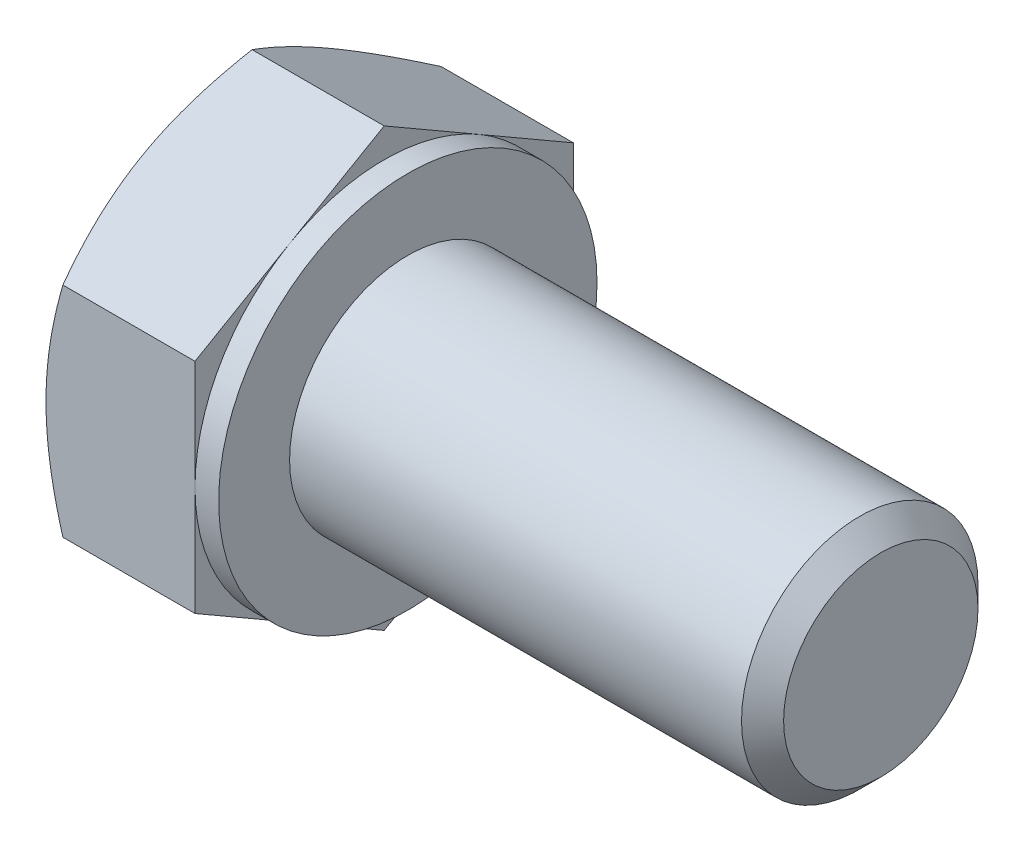
ISO-10303-21;
HEADER;
FILE_DESCRIPTION(('STEP AP214'),'2;1');
FILE_NAME('part.step','',(''),(''),'','','');
FILE_SCHEMA(('AUTOMOTIVE_DESIGN { 1 0 10303 214 1 1 1 1 }'));
ENDSEC;
DATA;
#1=APPLICATION_CONTEXT('core data for automotive mechanical design processes');
#2=APPLICATION_PROTOCOL_DEFINITION('international standard','automotive_design',2000,#1);
#3=PRODUCT_CONTEXT('',#1,'mechanical');
#4=PRODUCT('Part','Part','',(#3));
#5=PRODUCT_RELATED_PRODUCT_CATEGORY('part','',(#4));
#6=PRODUCT_DEFINITION_FORMATION('','',#4);
#7=PRODUCT_DEFINITION_CONTEXT('part definition',#1,'design');
#8=PRODUCT_DEFINITION('design','',#6,#7);
#9=PRODUCT_DEFINITION_SHAPE('','',#8);
#10=(LENGTH_UNIT() NAMED_UNIT(*) SI_UNIT(.MILLI.,.METRE.));
#11=(NAMED_UNIT(*) PLANE_ANGLE_UNIT() SI_UNIT($,.RADIAN.));
#12=(NAMED_UNIT(*) SI_UNIT($,.STERADIAN.) SOLID_ANGLE_UNIT());
#13=UNCERTAINTY_MEASURE_WITH_UNIT(LENGTH_MEASURE(1.E-05),#10,'distance_accuracy_value','');
#14=(GEOMETRIC_REPRESENTATION_CONTEXT(3) GLOBAL_UNCERTAINTY_ASSIGNED_CONTEXT((#13)) GLOBAL_UNIT_ASSIGNED_CONTEXT((#10,
#11,#12)) REPRESENTATION_CONTEXT('',''));
#15=CARTESIAN_POINT('',(0.,0.,0.));
#16=DIRECTION('',(0.,0.,1.));
#17=DIRECTION('',(1.,0.,0.));
#18=AXIS2_PLACEMENT_3D('',#15,#16,#17);
#19=CARTESIAN_POINT('',(3.65,2.3094010767585,-4.));
#20=DIRECTION('',(0.,-0.866025403784438,0.500000000000001));
#21=DIRECTION('',(0.,-0.500000000000001,-0.866025403784438));
#22=AXIS2_PLACEMENT_3D('',#19,#20,#21);
#23=PLANE('',#22);
#24=DIRECTION('',(0.,0.500000000000001,0.866025403784438));
#25=VECTOR('',#24,1.);
#26=CARTESIAN_POINT('',(3.15,2.3094010767585,-4.));
#27=LINE('',#26,#25);
#28=CARTESIAN_POINT('',(3.15,2.3094010767585,-4.));
#29=VERTEX_POINT('',#28);
#30=CARTESIAN_POINT('',(3.15,3.46410161513775,-2.));
#31=VERTEX_POINT('',#30);
#32=EDGE_CURVE('E168',#29,#31,#27,.T.);
#33=ORIENTED_EDGE('',*,*,#32,.F.);
#34=DIRECTION('',(-1.,0.,0.));
#35=VECTOR('',#34,1.);
#36=CARTESIAN_POINT('',(3.65,2.3094010767585,-4.));
#37=LINE('',#36,#35);
#38=CARTESIAN_POINT('',(0.35726558990816,2.3094010767585,-4.));
#39=VERTEX_POINT('',#38);
#40=EDGE_CURVE('E301',#29,#39,#37,.T.);
#41=ORIENTED_EDGE('',*,*,#40,.T.);
#42=CARTESIAN_POINT('',(0.357332259074767,4.61891762357085,0.0002));
#43=CARTESIAN_POINT('',(0.298717873648282,4.51743148381381,-0.175579150323228));
#44=CARTESIAN_POINT('',(0.245410321462263,4.41506932144052,-0.352875616326381));
#45=CARTESIAN_POINT('',(0.152361670746403,4.2085725054774,-0.710538593175706));
#46=CARTESIAN_POINT('',(0.112653489029704,4.10443418285647,-0.890911458970151));
#47=CARTESIAN_POINT('',(0.0508422152802784,3.89744813015756,-1.24942181870279));
#48=CARTESIAN_POINT('',(0.028327731522888,3.79463224655059,-1.42750415293514));
#49=CARTESIAN_POINT('',(0.00145062314658078,3.58851671999023,-1.78450671716651));
#50=CARTESIAN_POINT('',(-0.00293425857305782,3.48521782616117,-1.9634256496441));
#51=CARTESIAN_POINT('',(0.00619007293996873,3.29219970504619,-2.29774284219673));
#52=CARTESIAN_POINT('',(0.0174589539879923,3.20245157692486,-2.45319115998707));
#53=CARTESIAN_POINT('',(0.053173990798191,3.02354002635496,-2.76307505563506));
#54=CARTESIAN_POINT('',(0.0776323457115309,2.93437722268072,-2.91750956174413));
#55=CARTESIAN_POINT('',(0.138776064919287,2.75509682012354,-3.22803232777458));
#56=CARTESIAN_POINT('',(0.175720603654861,2.66500191089419,-3.3840812880631));
#57=CARTESIAN_POINT('',(0.259570072548024,2.486155802,-3.69385183540384));
#58=CARTESIAN_POINT('',(0.306455302212737,2.39740231122584,-3.84757739077378));
#59=CARTESIAN_POINT('',(0.357332259074764,2.30928560670466,-4.0002));
#60=B_SPLINE_CURVE_WITH_KNOTS('',3,(#42,#43,#44,#45,#46,#47,#48,#49,#50,#51,#52,#53,#54,#55,#56,
#57,#58,#59),.UNSPECIFIED.,.F.,.F.,(4,2,2,2,2,2,2,2,4),(0.,0.634047835695966,1.26961969224543,
1.88946157213122,2.50854226669297,3.04757825393386,3.58711366126904,4.13861653143764,
4.68903648037743),.UNSPECIFIED.);
#61=CARTESIAN_POINT('',(0.,3.46410161513775,-2.));
#62=VERTEX_POINT('',#61);
#63=EDGE_CURVE('E222',#62,#39,#60,.T.);
#64=ORIENTED_EDGE('',*,*,#63,.F.);
#65=CARTESIAN_POINT('',(0.357265589908162,4.61880215351701,0.));
#66=VERTEX_POINT('',#65);
#67=EDGE_CURVE('E59',#66,#62,#60,.T.);
#68=ORIENTED_EDGE('',*,*,#67,.F.);
#69=DIRECTION('',(-1.,0.,0.));
#70=VECTOR('',#69,1.);
#71=CARTESIAN_POINT('',(3.65,4.61880215351701,0.));
#72=LINE('',#71,#70);
#73=CARTESIAN_POINT('',(3.15,4.61880215351701,0.));
#74=VERTEX_POINT('',#73);
#75=EDGE_CURVE('E251',#74,#66,#72,.T.);
#76=ORIENTED_EDGE('',*,*,#75,.F.);
#77=EDGE_CURVE('E166',#31,#74,#27,.T.);
#78=ORIENTED_EDGE('',*,*,#77,.F.);
#79=EDGE_LOOP('',(#33,#41,#64,#68,#76,#78));
#80=FACE_BOUND('',#79,.T.);
#81=ADVANCED_FACE('F36',(#80),#23,.F.);
#82=CARTESIAN_POINT('',(3.65,4.61880215351701,0.));
#83=DIRECTION('',(0.,-0.866025403784438,-0.500000000000001));
#84=DIRECTION('',(0.,0.500000000000001,-0.866025403784438));
#85=AXIS2_PLACEMENT_3D('',#82,#83,#84);
#86=PLANE('',#85);
#87=DIRECTION('',(0.,-0.500000000000001,0.866025403784438));
#88=VECTOR('',#87,1.);
#89=CARTESIAN_POINT('',(3.15,4.61880215351701,0.));
#90=LINE('',#89,#88);
#91=CARTESIAN_POINT('',(3.15,3.46410161513775,2.));
#92=VERTEX_POINT('',#91);
#93=EDGE_CURVE('E165',#74,#92,#90,.T.);
#94=ORIENTED_EDGE('',*,*,#93,.F.);
#95=ORIENTED_EDGE('',*,*,#75,.T.);
#96=CARTESIAN_POINT('',(0.357332259074765,2.30928560670466,4.0002));
#97=CARTESIAN_POINT('',(0.29871787364828,2.4107717464617,3.82442084967677));
#98=CARTESIAN_POINT('',(0.245410321462261,2.51313390883499,3.64712438367362));
#99=CARTESIAN_POINT('',(0.152361670746402,2.71963072479811,3.28946140682429));
#100=CARTESIAN_POINT('',(0.112653489029703,2.82376904741904,3.10908854102985));
#101=CARTESIAN_POINT('',(0.050842215280278,3.03075510011795,2.75057818129721));
#102=CARTESIAN_POINT('',(0.0283277315228875,3.13357098372492,2.57249584706486));
#103=CARTESIAN_POINT('',(0.00145062314658079,3.33968651028528,2.21549328283349));
#104=CARTESIAN_POINT('',(-0.00293425857305726,3.44298540411434,2.0365743503559));
#105=CARTESIAN_POINT('',(0.00619007293996988,3.63600352522932,1.70225715780327));
#106=CARTESIAN_POINT('',(0.0174589539879935,3.72575165335065,1.54680884001293));
#107=CARTESIAN_POINT('',(0.0531739907981926,3.90466320392054,1.23692494436494));
#108=CARTESIAN_POINT('',(0.0776323457115329,3.99382600759478,1.08249043825587));
#109=CARTESIAN_POINT('',(0.138776064919289,4.17310641015197,0.771967672225422));
#110=CARTESIAN_POINT('',(0.175720603654863,4.26320131938131,0.615918711936898));
#111=CARTESIAN_POINT('',(0.259570072548027,4.4420474282755,0.306148164596161));
#112=CARTESIAN_POINT('',(0.306455302212739,4.53080091904966,0.152422609226221));
#113=CARTESIAN_POINT('',(0.357332259074767,4.61891762357085,-0.000199999999999708));
#114=B_SPLINE_CURVE_WITH_KNOTS('',3,(#96,#97,#98,#99,#100,#101,#102,#103,#104,#105,#106,#107,
#108,#109,#110,#111,#112,#113),.UNSPECIFIED.,.F.,.F.,(4,2,2,2,2,2,2,2,4),(0.,0.634047835695966,
1.26961969224543,1.88946157213122,2.50854226669297,3.04757825393386,3.58711366126903,
4.13861653143764,4.68903648037743),.UNSPECIFIED.);
#115=CARTESIAN_POINT('',(0.,3.46410161513775,2.));
#116=VERTEX_POINT('',#115);
#117=EDGE_CURVE('E219',#116,#66,#114,.T.);
#118=ORIENTED_EDGE('',*,*,#117,.F.);
#119=CARTESIAN_POINT('',(0.35726558990816,2.3094010767585,4.));
#120=VERTEX_POINT('',#119);
#121=EDGE_CURVE('E232',#120,#116,#114,.T.);
#122=ORIENTED_EDGE('',*,*,#121,.F.);
#123=DIRECTION('',(-1.,0.,0.));
#124=VECTOR('',#123,1.);
#125=CARTESIAN_POINT('',(3.65,2.3094010767585,4.));
#126=LINE('',#125,#124);
#127=CARTESIAN_POINT('',(3.15,2.3094010767585,4.));
#128=VERTEX_POINT('',#127);
#129=EDGE_CURVE('E257',#128,#120,#126,.T.);
#130=ORIENTED_EDGE('',*,*,#129,.F.);
#131=EDGE_CURVE('E133',#92,#128,#90,.T.);
#132=ORIENTED_EDGE('',*,*,#131,.F.);
#133=EDGE_LOOP('',(#94,#95,#118,#122,#130,#132));
#134=FACE_BOUND('',#133,.T.);
#135=ADVANCED_FACE('F239',(#134),#86,.F.);
#136=CARTESIAN_POINT('',(3.65,2.3094010767585,4.));
#137=DIRECTION('',(0.,0.,-1.));
#138=DIRECTION('',(0.,1.,0.));
#139=AXIS2_PLACEMENT_3D('',#136,#137,#138);
#140=PLANE('',#139);
#141=DIRECTION('',(0.,-1.,0.));
#142=VECTOR('',#141,1.);
#143=CARTESIAN_POINT('',(3.15,2.3094010767585,4.));
#144=LINE('',#143,#142);
#145=CARTESIAN_POINT('',(3.15,0.,4.));
#146=VERTEX_POINT('',#145);
#147=EDGE_CURVE('E127',#128,#146,#144,.T.);
#148=ORIENTED_EDGE('',*,*,#147,.F.);
#149=ORIENTED_EDGE('',*,*,#129,.T.);
#150=CARTESIAN_POINT('',(2.00011120589742,-6.30203842761111,4.));
#151=CARTESIAN_POINT('',(1.91454696498875,-6.12645846908573,4.));
#152=CARTESIAN_POINT('',(1.82977515877992,-5.95048585830454,4.));
#153=CARTESIAN_POINT('',(1.66226027831945,-5.59754684504876,4.));
#154=CARTESIAN_POINT('',(1.57951750565516,-5.42058029958676,4.));
#155=CARTESIAN_POINT('',(1.41610926315703,-5.06457985358151,4.));
#156=CARTESIAN_POINT('',(1.33545672742032,-4.88553999633136,4.));
#157=CARTESIAN_POINT('',(1.17732358085362,-4.52607013308824,4.));
#158=CARTESIAN_POINT('',(1.09984282639236,-4.34564019048467,4.));
#159=CARTESIAN_POINT('',(0.946328318347811,-3.97695712450866,4.));
#160=CARTESIAN_POINT('',(0.870432704529686,-3.7886461766802,4.));
#161=CARTESIAN_POINT('',(0.724150215973385,-3.40985798992394,4.));
#162=CARTESIAN_POINT('',(0.653763945273167,-3.21938051607554,4.));
#163=CARTESIAN_POINT('',(0.520275623504079,-2.83628177128504,4.));
#164=CARTESIAN_POINT('',(0.457159651374151,-2.64366539864627,4.));
#165=CARTESIAN_POINT('',(0.340171517554838,-2.25567134331568,4.));
#166=CARTESIAN_POINT('',(0.286296547637716,-2.06029451909569,4.));
#167=CARTESIAN_POINT('',(0.190596079795566,-1.66775019580151,4.));
#168=CARTESIAN_POINT('',(0.148703055516463,-1.47059946092578,4.));
#169=CARTESIAN_POINT('',(0.0792701945625795,-1.07374632347739,4.));
#170=CARTESIAN_POINT('',(0.0517287925825719,-0.874044201615003,4.));
#171=CARTESIAN_POINT('',(0.013551736981097,-0.475733691865657,4.));
#172=CARTESIAN_POINT('',(0.00269106568150254,-0.277147418102504,4.));
#173=CARTESIAN_POINT('',(-0.00180277185473747,0.120241437274129,4.));
#174=CARTESIAN_POINT('',(0.00456430935448203,0.319044021953532,4.));
#175=CARTESIAN_POINT('',(0.0293199842587319,0.653649133068299,4.));
#176=CARTESIAN_POINT('',(0.043348769660897,0.789796206499814,4.));
#177=CARTESIAN_POINT('',(0.0786650587211751,1.0611517992991,4.));
#178=CARTESIAN_POINT('',(0.0999534653997827,1.1963601997699,4.));
#179=CARTESIAN_POINT('',(0.173595113230304,1.60036108975571,4.));
#180=CARTESIAN_POINT('',(0.235713609865279,1.86739658303732,4.));
#181=CARTESIAN_POINT('',(0.344187907647022,2.26690842404958,4.));
#182=CARTESIAN_POINT('',(0.383434484333358,2.40143348571872,4.));
#183=CARTESIAN_POINT('',(0.466191102609247,2.66917849490935,4.));
#184=CARTESIAN_POINT('',(0.509701177188774,2.80239843232331,4.));
#185=CARTESIAN_POINT('',(0.600271094434187,3.06757339383921,4.));
#186=CARTESIAN_POINT('',(0.647329943862151,3.19952876030404,4.));
#187=CARTESIAN_POINT('',(0.744425096631931,3.46233234223973,4.));
#188=CARTESIAN_POINT('',(0.794461330917676,3.59318058330841,4.));
#189=CARTESIAN_POINT('',(0.933355739925497,3.94627302392211,4.));
#190=CARTESIAN_POINT('',(1.0245987610664,4.16757823857484,4.));
#191=CARTESIAN_POINT('',(1.212472284956,4.60789849928791,4.));
#192=CARTESIAN_POINT('',(1.30910339372387,4.82691328443148,4.));
#193=CARTESIAN_POINT('',(1.50647026715799,5.26317250533755,4.));
#194=CARTESIAN_POINT('',(1.60720747010151,5.48041628821979,4.));
#195=CARTESIAN_POINT('',(1.81181128644257,5.91342831956033,4.));
#196=CARTESIAN_POINT('',(1.91567799687904,6.12919652200915,4.));
#197=CARTESIAN_POINT('',(2.12601769056008,6.55988022094133,4.));
#198=CARTESIAN_POINT('',(2.23249454580639,6.77479382248027,4.));
#199=CARTESIAN_POINT('',(2.44739203770408,7.20364803216284,4.));
#200=CARTESIAN_POINT('',(2.55581269515436,7.41758862986447,4.));
#201=CARTESIAN_POINT('',(2.88334503640577,8.05812603677695,4.));
#202=CARTESIAN_POINT('',(3.10477549508713,8.48353660654958,4.));
#203=CARTESIAN_POINT('',(3.52798949521967,9.28704830568598,4.));
#204=CARTESIAN_POINT('',(3.72935795236482,9.66536913109685,4.));
#205=CARTESIAN_POINT('',(4.13451859351915,10.4207405604373,4.));
#206=CARTESIAN_POINT('',(4.33831092861575,10.7977910832853,4.));
#207=CARTESIAN_POINT('',(4.74699525708428,11.5496417902084,4.));
#208=CARTESIAN_POINT('',(4.95188119417862,11.9244452714923,4.));
#209=CARTESIAN_POINT('',(5.36302659718326,12.6732594632005,4.));
#210=CARTESIAN_POINT('',(5.56928595205576,13.0472702345667,4.));
#211=CARTESIAN_POINT('',(5.7760450350038,13.42100281196,4.));
#212=B_SPLINE_CURVE_WITH_KNOTS('',3,(#150,#151,#152,#153,#154,#155,#156,#157,#158,#159,#160,
#161,#162,#163,#164,#165,#166,#167,#168,#169,#170,#171,#172,#173,#174,#175,#176,#177,#178,#179,
#180,#181,#182,#183,#184,#185,#186,#187,#188,#189,#190,#191,#192,#193,#194,#195,#196,#197,#198,
#199,#200,#201,#202,#203,#204,#205,#206,#207,#208,#209,#210,#211),.UNSPECIFIED.,.F.,.F.,(4,2,2,
2,2,2,2,2,2,2,2,2,2,2,2,2,2,2,2,2,2,2,2,2,2,2,2,2,2,2,4),(0.,0.585964080082647,1.17201473397361,
1.76109183587772,2.35014223237614,2.95916537364923,3.56825519425103,4.17615863853846,
4.78387701983943,5.38809979056439,5.99225664601462,6.58818973021546,7.18413137397509,
7.59453803053126,8.00499575598947,8.82630884150172,9.24666973898509,9.66703388938198,
10.0872808210163,10.5075180094363,11.2255416710968,11.9436462552169,12.6620045748535,
13.3803851921263,14.0999050723894,14.8194326561991,16.2581595564571,17.5438734456803,
18.8296679016496,20.1111105471136,21.3924508191106),.UNSPECIFIED.);
#213=CARTESIAN_POINT('',(0.,0.,4.));
#214=VERTEX_POINT('',#213);
#215=EDGE_CURVE('E233',#214,#120,#212,.T.);
#216=ORIENTED_EDGE('',*,*,#215,.F.);
#217=CARTESIAN_POINT('',(0.357265589908159,-2.30940107675849,4.));
#218=VERTEX_POINT('',#217);
#219=EDGE_CURVE('E310',#218,#214,#212,.T.);
#220=ORIENTED_EDGE('',*,*,#219,.F.);
#221=DIRECTION('',(-1.,0.,0.));
#222=VECTOR('',#221,1.);
#223=CARTESIAN_POINT('',(3.65,-2.30940107675849,4.));
#224=LINE('',#223,#222);
#225=CARTESIAN_POINT('',(3.15,-2.30940107675849,4.));
#226=VERTEX_POINT('',#225);
#227=EDGE_CURVE('E159',#226,#218,#224,.T.);
#228=ORIENTED_EDGE('',*,*,#227,.F.);
#229=EDGE_CURVE('E137',#146,#226,#144,.T.);
#230=ORIENTED_EDGE('',*,*,#229,.F.);
#231=EDGE_LOOP('',(#148,#149,#216,#220,#228,#230));
#232=FACE_BOUND('',#231,.T.);
#233=ADVANCED_FACE('F157',(#232),#140,.F.);
#234=CARTESIAN_POINT('',(3.65,-4.61880215351701,0.));
#235=DIRECTION('',(0.,0.866025403784437,-0.500000000000002));
#236=DIRECTION('',(0.,0.500000000000002,0.866025403784438));
#237=AXIS2_PLACEMENT_3D('',#234,#235,#236);
#238=PLANE('',#237);
#239=DIRECTION('',(0.,-0.500000000000002,-0.866025403784438));
#240=VECTOR('',#239,1.);
#241=CARTESIAN_POINT('',(3.15,-4.61880215351701,0.));
#242=LINE('',#241,#240);
#243=CARTESIAN_POINT('',(3.15,-3.46410161513775,2.00000000000001));
#244=VERTEX_POINT('',#243);
#245=EDGE_CURVE('E144',#226,#244,#242,.T.);
#246=ORIENTED_EDGE('',*,*,#245,.F.);
#247=ORIENTED_EDGE('',*,*,#227,.T.);
#248=CARTESIAN_POINT('',(0.357332259074767,-4.61891762357085,-0.000200000000000053));
#249=CARTESIAN_POINT('',(0.298717873648283,-4.51743148381381,0.175579150323228));
#250=CARTESIAN_POINT('',(0.245410321462263,-4.41506932144052,0.35287561632638));
#251=CARTESIAN_POINT('',(0.152361670746403,-4.20857250547739,0.710538593175706));
#252=CARTESIAN_POINT('',(0.112653489029703,-4.10443418285647,0.89091145897015));
#253=CARTESIAN_POINT('',(0.0508422152802778,-3.89744813015756,1.24942181870279));
#254=CARTESIAN_POINT('',(0.0283277315228875,-3.79463224655059,1.42750415293514));
#255=CARTESIAN_POINT('',(0.00145062314657991,-3.58851671999023,1.78450671716651));
#256=CARTESIAN_POINT('',(-0.00293425857305919,-3.48521782616117,1.9634256496441));
#257=CARTESIAN_POINT('',(0.00619007293996711,-3.29219970504618,2.29774284219673));
#258=CARTESIAN_POINT('',(0.0174589539879908,-3.20245157692486,2.45319115998706));
#259=CARTESIAN_POINT('',(0.0531739907981893,-3.02354002635496,2.76307505563505));
#260=CARTESIAN_POINT('',(0.0776323457115291,-2.93437722268072,2.91750956174413));
#261=CARTESIAN_POINT('',(0.138776064919285,-2.75509682012353,3.22803232777458));
#262=CARTESIAN_POINT('',(0.175720603654859,-2.66500191089419,3.3840812880631));
#263=CARTESIAN_POINT('',(0.259570072548022,-2.486155802,3.69385183540384));
#264=CARTESIAN_POINT('',(0.306455302212735,-2.39740231122584,3.84757739077378));
#265=CARTESIAN_POINT('',(0.357332259074762,-2.30928560670466,4.0002));
#266=B_SPLINE_CURVE_WITH_KNOTS('',3,(#248,#249,#250,#251,#252,#253,#254,#255,#256,#257,#258,
#259,#260,#261,#262,#263,#264,#265),.UNSPECIFIED.,.F.,.F.,(4,2,2,2,2,2,2,2,4),(0.,
0.634047835695966,1.26961969224543,1.88946157213122,2.50854226669297,3.04757825393386,
3.58711366126904,4.13861653143764,4.68903648037744),.UNSPECIFIED.);
#267=CARTESIAN_POINT('',(0.,-3.46410161513775,2.00000000000001));
#268=VERTEX_POINT('',#267);
#269=EDGE_CURVE('E221',#268,#218,#266,.T.);
#270=ORIENTED_EDGE('',*,*,#269,.F.);
#271=CARTESIAN_POINT('',(0.357265589908163,-4.61880215351701,0.));
#272=VERTEX_POINT('',#271);
#273=EDGE_CURVE('E213',#272,#268,#266,.T.);
#274=ORIENTED_EDGE('',*,*,#273,.F.);
#275=DIRECTION('',(-1.,0.,0.));
#276=VECTOR('',#275,1.);
#277=CARTESIAN_POINT('',(3.65,-4.61880215351701,0.));
#278=LINE('',#277,#276);
#279=CARTESIAN_POINT('',(3.15,-4.61880215351701,0.));
#280=VERTEX_POINT('',#279);
#281=EDGE_CURVE('E295',#280,#272,#278,.T.);
#282=ORIENTED_EDGE('',*,*,#281,.F.);
#283=EDGE_CURVE('E160',#244,#280,#242,.T.);
#284=ORIENTED_EDGE('',*,*,#283,.F.);
#285=EDGE_LOOP('',(#246,#247,#270,#274,#282,#284));
#286=FACE_BOUND('',#285,.T.);
#287=ADVANCED_FACE('F205',(#286),#238,.F.);
#288=CARTESIAN_POINT('',(3.65,-2.30940107675851,-4.));
#289=DIRECTION('',(0.,0.866025403784439,0.5));
#290=DIRECTION('',(0.,-0.5,0.866025403784439));
#291=AXIS2_PLACEMENT_3D('',#288,#289,#290);
#292=PLANE('',#291);
#293=DIRECTION('',(0.,0.5,-0.866025403784439));
#294=VECTOR('',#293,1.);
#295=CARTESIAN_POINT('',(3.15,-2.30940107675851,-4.));
#296=LINE('',#295,#294);
#297=CARTESIAN_POINT('',(3.15,-3.46410161513775,-2.));
#298=VERTEX_POINT('',#297);
#299=EDGE_CURVE('E514',#280,#298,#296,.T.);
#300=ORIENTED_EDGE('',*,*,#299,.F.);
#301=ORIENTED_EDGE('',*,*,#281,.T.);
#302=CARTESIAN_POINT('',(0.357332259074767,-2.30928560670467,-4.0002));
#303=CARTESIAN_POINT('',(0.298717873648283,-2.41077174646171,-3.82442084967677));
#304=CARTESIAN_POINT('',(0.245410321462263,-2.513133908835,-3.64712438367362));
#305=CARTESIAN_POINT('',(0.152361670746404,-2.71963072479812,-3.28946140682429));
#306=CARTESIAN_POINT('',(0.112653489029705,-2.82376904741905,-3.10908854102985));
#307=CARTESIAN_POINT('',(0.05084221528028,-3.03075510011795,-2.75057818129721));
#308=CARTESIAN_POINT('',(0.0283277315228898,-3.13357098372492,-2.57249584706486));
#309=CARTESIAN_POINT('',(0.00145062314658283,-3.33968651028529,-2.21549328283349));
#310=CARTESIAN_POINT('',(-0.00293425857305578,-3.44298540411434,-2.0365743503559));
#311=CARTESIAN_POINT('',(0.00619007293997138,-3.63600352522933,-1.70225715780327));
#312=CARTESIAN_POINT('',(0.0174589539879954,-3.72575165335065,-1.54680884001293));
#313=CARTESIAN_POINT('',(0.0531739907981943,-3.90466320392055,-1.23692494436494));
#314=CARTESIAN_POINT('',(0.0776323457115339,-3.99382600759479,-1.08249043825587));
#315=CARTESIAN_POINT('',(0.13877606491929,-4.17310641015197,-0.771967672225422));
#316=CARTESIAN_POINT('',(0.175720603654864,-4.26320131938131,-0.615918711936898));
#317=CARTESIAN_POINT('',(0.259570072548027,-4.44204742827551,-0.306148164596161));
#318=CARTESIAN_POINT('',(0.30645530221274,-4.53080091904966,-0.152422609226221));
#319=CARTESIAN_POINT('',(0.357332259074767,-4.61891762357085,0.000199999999999275));
#320=B_SPLINE_CURVE_WITH_KNOTS('',3,(#302,#303,#304,#305,#306,#307,#308,#309,#310,#311,#312,
#313,#314,#315,#316,#317,#318,#319),.UNSPECIFIED.,.F.,.F.,(4,2,2,2,2,2,2,2,4),(0.,
0.634047835695966,1.26961969224543,1.88946157213122,2.50854226669297,3.04757825393386,
3.58711366126903,4.13861653143764,4.68903648037743),.UNSPECIFIED.);
#321=CARTESIAN_POINT('',(0.,-3.46410161513776,-2.));
#322=VERTEX_POINT('',#321);
#323=EDGE_CURVE('E220',#322,#272,#320,.T.);
#324=ORIENTED_EDGE('',*,*,#323,.F.);
#325=CARTESIAN_POINT('',(0.357265589908046,-2.30940107675869,-4.));
#326=VERTEX_POINT('',#325);
#327=EDGE_CURVE('E182',#326,#322,#320,.T.);
#328=ORIENTED_EDGE('',*,*,#327,.F.);
#329=DIRECTION('',(-1.,0.,0.));
#330=VECTOR('',#329,1.);
#331=CARTESIAN_POINT('',(3.65,-2.30940107675851,-4.));
#332=LINE('',#331,#330);
#333=CARTESIAN_POINT('',(3.15,-2.30940107675851,-4.));
#334=VERTEX_POINT('',#333);
#335=EDGE_CURVE('E302',#334,#326,#332,.T.);
#336=ORIENTED_EDGE('',*,*,#335,.F.);
#337=EDGE_CURVE('E155',#298,#334,#296,.T.);
#338=ORIENTED_EDGE('',*,*,#337,.F.);
#339=EDGE_LOOP('',(#300,#301,#324,#328,#336,#338));
#340=FACE_BOUND('',#339,.T.);
#341=ADVANCED_FACE('F198',(#340),#292,.F.);
#342=CARTESIAN_POINT('',(3.65,2.3094010767585,-4.));
#343=DIRECTION('',(0.,0.,1.));
#344=DIRECTION('',(0.,-1.,0.));
#345=AXIS2_PLACEMENT_3D('',#342,#343,#344);
#346=PLANE('',#345);
#347=DIRECTION('',(0.,1.,0.));
#348=VECTOR('',#347,1.);
#349=CARTESIAN_POINT('',(3.15,2.3094010767585,-4.));
#350=LINE('',#349,#348);
#351=CARTESIAN_POINT('',(3.15,0.,-4.));
#352=VERTEX_POINT('',#351);
#353=EDGE_CURVE('E11',#334,#352,#350,.T.);
#354=ORIENTED_EDGE('',*,*,#353,.F.);
#355=ORIENTED_EDGE('',*,*,#335,.T.);
#356=CARTESIAN_POINT('',(2.00011120589743,-6.30203842761113,-4.));
#357=CARTESIAN_POINT('',(1.91454696498875,-6.12645846908575,-4.));
#358=CARTESIAN_POINT('',(1.82977515877993,-5.95048585830456,-4.));
#359=CARTESIAN_POINT('',(1.66226027831945,-5.59754684504878,-4.));
#360=CARTESIAN_POINT('',(1.57951750565517,-5.42058029958678,-4.));
#361=CARTESIAN_POINT('',(1.41610926315704,-5.06457985358153,-4.));
#362=CARTESIAN_POINT('',(1.33545672742033,-4.88553999633138,-4.));
#363=CARTESIAN_POINT('',(1.17732358085363,-4.52607013308826,-4.));
#364=CARTESIAN_POINT('',(1.09984282639237,-4.34564019048468,-4.));
#365=CARTESIAN_POINT('',(0.946328318347818,-3.97695712450867,-4.));
#366=CARTESIAN_POINT('',(0.870432704529693,-3.78864617668021,-4.));
#367=CARTESIAN_POINT('',(0.724150215973391,-3.40985798992396,-4.));
#368=CARTESIAN_POINT('',(0.653763945273173,-3.21938051607555,-4.));
#369=CARTESIAN_POINT('',(0.520275623504085,-2.83628177128505,-4.));
#370=CARTESIAN_POINT('',(0.457159651374156,-2.64366539864629,-4.));
#371=CARTESIAN_POINT('',(0.340171517554842,-2.25567134331569,-4.));
#372=CARTESIAN_POINT('',(0.286296547637721,-2.0602945190957,-4.));
#373=CARTESIAN_POINT('',(0.19059607979557,-1.66775019580152,-4.));
#374=CARTESIAN_POINT('',(0.148703055516466,-1.47059946092579,-4.));
#375=CARTESIAN_POINT('',(0.0792701945625822,-1.0737463234774,-4.));
#376=CARTESIAN_POINT('',(0.0517287925825743,-0.874044201615014,-4.));
#377=CARTESIAN_POINT('',(0.0135517369810986,-0.475733691865668,-4.));
#378=CARTESIAN_POINT('',(0.00269106568150375,-0.277147418102515,-4.));
#379=CARTESIAN_POINT('',(-0.00180277185473668,0.120241437274119,-4.));
#380=CARTESIAN_POINT('',(0.00456430935448281,0.319044021953523,-4.));
#381=CARTESIAN_POINT('',(0.0293199842587321,0.653649133068289,-4.));
#382=CARTESIAN_POINT('',(0.0433487696608968,0.789796206499805,-4.));
#383=CARTESIAN_POINT('',(0.0786650587211743,1.06115179929909,-4.));
#384=CARTESIAN_POINT('',(0.0999534653997818,1.19636019976989,-4.));
#385=CARTESIAN_POINT('',(0.173595113230302,1.6003610897557,-4.));
#386=CARTESIAN_POINT('',(0.235713609865278,1.86739658303731,-4.));
#387=CARTESIAN_POINT('',(0.34418790764702,2.26690842404957,-4.));
#388=CARTESIAN_POINT('',(0.383434484333355,2.40143348571871,-4.));
#389=CARTESIAN_POINT('',(0.466191102609244,2.66917849490934,-4.));
#390=CARTESIAN_POINT('',(0.509701177188771,2.80239843232329,-4.));
#391=CARTESIAN_POINT('',(0.600271094434183,3.0675733938392,-4.));
#392=CARTESIAN_POINT('',(0.647329943862146,3.19952876030402,-4.));
#393=CARTESIAN_POINT('',(0.744425096631926,3.46233234223972,-4.));
#394=CARTESIAN_POINT('',(0.794461330917671,3.5931805833084,-4.));
#395=CARTESIAN_POINT('',(0.933355739925493,3.94627302392209,-4.));
#396=CARTESIAN_POINT('',(1.0245987610664,4.16757823857483,-4.));
#397=CARTESIAN_POINT('',(1.21247228495599,4.6078984992879,-4.));
#398=CARTESIAN_POINT('',(1.30910339372387,4.82691328443147,-4.));
#399=CARTESIAN_POINT('',(1.50647026715798,5.26317250533754,-4.));
#400=CARTESIAN_POINT('',(1.60720747010151,5.48041628821978,-4.));
#401=CARTESIAN_POINT('',(1.81181128644257,5.91342831956032,-4.));
#402=CARTESIAN_POINT('',(1.91567799687904,6.12919652200915,-4.));
#403=CARTESIAN_POINT('',(2.12601769056008,6.55988022094132,-4.));
#404=CARTESIAN_POINT('',(2.23249454580639,6.77479382248026,-4.));
#405=CARTESIAN_POINT('',(2.44739203770407,7.20364803216283,-4.));
#406=CARTESIAN_POINT('',(2.55581269515436,7.41758862986447,-4.));
#407=CARTESIAN_POINT('',(2.88334503640577,8.05812603677695,-4.));
#408=CARTESIAN_POINT('',(3.10477549508713,8.48353660654958,-4.));
#409=CARTESIAN_POINT('',(3.52798949521967,9.28704830568598,-4.));
#410=CARTESIAN_POINT('',(3.72935795236481,9.66536913109685,-4.));
#411=CARTESIAN_POINT('',(4.13451859351915,10.4207405604373,-4.));
#412=CARTESIAN_POINT('',(4.33831092861575,10.7977910832853,-4.));
#413=CARTESIAN_POINT('',(4.74699525708428,11.5496417902084,-4.));
#414=CARTESIAN_POINT('',(4.95188119417862,11.9244452714923,-4.));
#415=CARTESIAN_POINT('',(5.36302659718326,12.6732594632005,-4.));
#416=CARTESIAN_POINT('',(5.56928595205576,13.0472702345667,-4.));
#417=CARTESIAN_POINT('',(5.7760450350038,13.42100281196,-4.));
#418=B_SPLINE_CURVE_WITH_KNOTS('',3,(#356,#357,#358,#359,#360,#361,#362,#363,#364,#365,#366,
#367,#368,#369,#370,#371,#372,#373,#374,#375,#376,#377,#378,#379,#380,#381,#382,#383,#384,#385,
#386,#387,#388,#389,#390,#391,#392,#393,#394,#395,#396,#397,#398,#399,#400,#401,#402,#403,#404,
#405,#406,#407,#408,#409,#410,#411,#412,#413,#414,#415,#416,#417),.UNSPECIFIED.,.F.,.F.,(4,2,2,
2,2,2,2,2,2,2,2,2,2,2,2,2,2,2,2,2,2,2,2,2,2,2,2,2,2,2,4),(0.,0.585964080082646,1.17201473397361,
1.76109183587772,2.35014223237614,2.95916537364923,3.56825519425104,4.17615863853847,
4.78387701983944,5.3880997905644,5.99225664601462,6.58818973021547,7.1841313739751,
7.59453803053127,8.00499575598947,8.82630884150173,9.2466697389851,9.66703388938198,
10.0872808210163,10.5075180094363,11.2255416710968,11.9436462552169,12.6620045748535,
13.3803851921263,14.0999050723894,14.8194326561991,16.2581595564571,17.5438734456804,
18.8296679016496,20.1111105471136,21.3924508191106),.UNSPECIFIED.);
#419=CARTESIAN_POINT('',(0.,0.,-4.));
#420=VERTEX_POINT('',#419);
#421=EDGE_CURVE('E172',#420,#326,#418,.F.);
#422=ORIENTED_EDGE('',*,*,#421,.F.);
#423=EDGE_CURVE('E181',#39,#420,#418,.F.);
#424=ORIENTED_EDGE('',*,*,#423,.F.);
#425=ORIENTED_EDGE('',*,*,#40,.F.);
#426=EDGE_CURVE('E40',#352,#29,#350,.T.);
#427=ORIENTED_EDGE('',*,*,#426,.F.);
#428=EDGE_LOOP('',(#354,#355,#422,#424,#425,#427));
#429=FACE_BOUND('',#428,.T.);
#430=ADVANCED_FACE('F193',(#429),#346,.F.);
#431=CARTESIAN_POINT('',(0.,0.,0.));
#432=DIRECTION('',(1.,0.,0.));
#433=DIRECTION('',(0.,0.,-1.));
#434=AXIS2_PLACEMENT_3D('',#431,#432,#433);
#435=CONICAL_SURFACE('',#434,4.,1.0471975511966);
#436=ORIENTED_EDGE('',*,*,#327,.T.);
#437=CARTESIAN_POINT('',(0.,0.,0.));
#438=DIRECTION('',(1.,0.,0.));
#439=DIRECTION('',(0.,0.,-1.));
#440=AXIS2_PLACEMENT_3D('',#437,#438,#439);
#441=CIRCLE('',#440,4.);
#442=EDGE_CURVE('E256',#322,#420,#441,.T.);
#443=ORIENTED_EDGE('',*,*,#442,.T.);
#444=ORIENTED_EDGE('',*,*,#421,.T.);
#445=EDGE_LOOP('',(#436,#443,#444));
#446=FACE_BOUND('',#445,.T.);
#447=ADVANCED_FACE('F197',(#446),#435,.T.);
#448=ORIENTED_EDGE('',*,*,#273,.T.);
#449=EDGE_CURVE('E260',#268,#322,#441,.T.);
#450=ORIENTED_EDGE('',*,*,#449,.T.);
#451=ORIENTED_EDGE('',*,*,#323,.T.);
#452=EDGE_LOOP('',(#448,#450,#451));
#453=FACE_BOUND('',#452,.T.);
#454=ADVANCED_FACE('F283',(#453),#435,.T.);
#455=ORIENTED_EDGE('',*,*,#219,.T.);
#456=EDGE_CURVE('E274',#214,#268,#441,.T.);
#457=ORIENTED_EDGE('',*,*,#456,.T.);
#458=ORIENTED_EDGE('',*,*,#269,.T.);
#459=EDGE_LOOP('',(#455,#457,#458));
#460=FACE_BOUND('',#459,.T.);
#461=ADVANCED_FACE('F189',(#460),#435,.T.);
#462=ORIENTED_EDGE('',*,*,#215,.T.);
#463=ORIENTED_EDGE('',*,*,#121,.T.);
#464=CARTESIAN_POINT('',(0.,0.,0.));
#465=DIRECTION('',(-1.,0.,0.));
#466=DIRECTION('',(0.,0.,1.));
#467=AXIS2_PLACEMENT_3D('',#464,#465,#466);
#468=CIRCLE('',#467,4.);
#469=EDGE_CURVE('E169',#214,#116,#468,.T.);
#470=ORIENTED_EDGE('',*,*,#469,.F.);
#471=EDGE_LOOP('',(#462,#463,#470));
#472=FACE_BOUND('',#471,.T.);
#473=ADVANCED_FACE('F320',(#472),#435,.T.);
#474=ORIENTED_EDGE('',*,*,#117,.T.);
#475=ORIENTED_EDGE('',*,*,#67,.T.);
#476=EDGE_CURVE('E269',#62,#116,#441,.T.);
#477=ORIENTED_EDGE('',*,*,#476,.T.);
#478=EDGE_LOOP('',(#474,#475,#477));
#479=FACE_BOUND('',#478,.T.);
#480=ADVANCED_FACE('F321',(#479),#435,.T.);
#481=ORIENTED_EDGE('',*,*,#63,.T.);
#482=ORIENTED_EDGE('',*,*,#423,.T.);
#483=EDGE_CURVE('E262',#420,#62,#441,.T.);
#484=ORIENTED_EDGE('',*,*,#483,.T.);
#485=EDGE_LOOP('',(#481,#482,#484));
#486=FACE_BOUND('',#485,.T.);
#487=ADVANCED_FACE('F297',(#486),#435,.T.);
#488=CARTESIAN_POINT('',(0.45625,0.192376607408562,0.0332122445882987));
#489=DIRECTION('',(-1.,0.,0.));
#490=DIRECTION('',(0.,0.,1.));
#491=AXIS2_PLACEMENT_3D('',#488,#489,#490);
#492=PLANE('',#491);
#493=CARTESIAN_POINT('',(0.45625,0.192376607408562,0.0332122445882987));
#494=DIRECTION('',(-1.,0.,0.));
#495=DIRECTION('',(0.,0.,1.));
#496=AXIS2_PLACEMENT_3D('',#493,#494,#495);
#497=CIRCLE('',#496,3.5);
#498=CARTESIAN_POINT('',(0.45625,0.192376607408562,3.5332122445883));
#499=VERTEX_POINT('',#498);
#500=EDGE_CURVE('E316',#499,#499,#497,.T.);
#501=ORIENTED_EDGE('',*,*,#500,.T.);
#502=EDGE_LOOP('',(#501));
#503=FACE_BOUND('',#502,.T.);
#504=ADVANCED_FACE('F327',(#503),#492,.T.);
#505=CARTESIAN_POINT('',(0.45625,0.192376607408562,0.0332122445882987));
#506=DIRECTION('',(-1.,0.,0.));
#507=DIRECTION('',(0.,0.,1.));
#508=AXIS2_PLACEMENT_3D('',#505,#506,#507);
#509=CYLINDRICAL_SURFACE('',#508,3.5);
#510=ORIENTED_EDGE('',*,*,#500,.F.);
#511=EDGE_LOOP('',(#510));
#512=FACE_BOUND('',#511,.T.);
#513=CARTESIAN_POINT('',(0.,0.192376607408562,0.0332122445882987));
#514=DIRECTION('',(-1.,0.,0.));
#515=DIRECTION('',(0.,0.,1.));
#516=AXIS2_PLACEMENT_3D('',#513,#514,#515);
#517=CIRCLE('',#516,3.5);
#518=CARTESIAN_POINT('',(0.,0.192376607408562,3.5332122445883));
#519=VERTEX_POINT('',#518);
#520=EDGE_CURVE('E314',#519,#519,#517,.T.);
#521=ORIENTED_EDGE('',*,*,#520,.T.);
#522=EDGE_LOOP('',(#521));
#523=FACE_BOUND('',#522,.T.);
#524=ADVANCED_FACE('F374',(#512,#523),#509,.F.);
#525=CARTESIAN_POINT('',(0.,4.61880215351701,0.));
#526=DIRECTION('',(1.,0.,0.));
#527=DIRECTION('',(0.,0.,-1.));
#528=AXIS2_PLACEMENT_3D('',#525,#526,#527);
#529=PLANE('',#528);
#530=ORIENTED_EDGE('',*,*,#520,.F.);
#531=EDGE_LOOP('',(#530));
#532=FACE_BOUND('',#531,.T.);
#533=ORIENTED_EDGE('',*,*,#483,.F.);
#534=ORIENTED_EDGE('',*,*,#442,.F.);
#535=ORIENTED_EDGE('',*,*,#449,.F.);
#536=ORIENTED_EDGE('',*,*,#456,.F.);
#537=ORIENTED_EDGE('',*,*,#469,.T.);
#538=ORIENTED_EDGE('',*,*,#476,.F.);
#539=EDGE_LOOP('',(#533,#534,#535,#536,#537,#538));
#540=FACE_BOUND('',#539,.T.);
#541=ADVANCED_FACE('F200',(#532,#540),#529,.F.);
#542=CARTESIAN_POINT('',(3.15,4.,0.));
#543=DIRECTION('',(1.,0.,0.));
#544=DIRECTION('',(0.,0.,-1.));
#545=AXIS2_PLACEMENT_3D('',#542,#543,#544);
#546=PLANE('',#545);
#547=ORIENTED_EDGE('',*,*,#32,.T.);
#548=CARTESIAN_POINT('',(3.15,0.,0.));
#549=DIRECTION('',(-1.,0.,0.));
#550=DIRECTION('',(0.,0.,1.));
#551=AXIS2_PLACEMENT_3D('',#548,#549,#550);
#552=CIRCLE('',#551,4.);
#553=EDGE_CURVE('E51',#31,#352,#552,.T.);
#554=ORIENTED_EDGE('',*,*,#553,.T.);
#555=ORIENTED_EDGE('',*,*,#426,.T.);
#556=EDGE_LOOP('',(#547,#554,#555));
#557=FACE_BOUND('',#556,.T.);
#558=ADVANCED_FACE('F373',(#557),#546,.T.);
#559=ORIENTED_EDGE('',*,*,#77,.T.);
#560=ORIENTED_EDGE('',*,*,#93,.T.);
#561=EDGE_CURVE('E154',#92,#31,#552,.T.);
#562=ORIENTED_EDGE('',*,*,#561,.T.);
#563=EDGE_LOOP('',(#559,#560,#562));
#564=FACE_BOUND('',#563,.T.);
#565=ADVANCED_FACE('F498',(#564),#546,.T.);
#566=ORIENTED_EDGE('',*,*,#131,.T.);
#567=ORIENTED_EDGE('',*,*,#147,.T.);
#568=EDGE_CURVE('E131',#146,#92,#552,.T.);
#569=ORIENTED_EDGE('',*,*,#568,.T.);
#570=EDGE_LOOP('',(#566,#567,#569));
#571=FACE_BOUND('',#570,.T.);
#572=ADVANCED_FACE('F129',(#571),#546,.T.);
#573=ORIENTED_EDGE('',*,*,#229,.T.);
#574=ORIENTED_EDGE('',*,*,#245,.T.);
#575=EDGE_CURVE('E141',#244,#146,#552,.T.);
#576=ORIENTED_EDGE('',*,*,#575,.T.);
#577=EDGE_LOOP('',(#573,#574,#576));
#578=FACE_BOUND('',#577,.T.);
#579=ADVANCED_FACE('F142',(#578),#546,.T.);
#580=ORIENTED_EDGE('',*,*,#283,.T.);
#581=ORIENTED_EDGE('',*,*,#299,.T.);
#582=EDGE_CURVE('E148',#298,#244,#552,.T.);
#583=ORIENTED_EDGE('',*,*,#582,.T.);
#584=EDGE_LOOP('',(#580,#581,#583));
#585=FACE_BOUND('',#584,.T.);
#586=ADVANCED_FACE('F474',(#585),#546,.T.);
#587=ORIENTED_EDGE('',*,*,#337,.T.);
#588=ORIENTED_EDGE('',*,*,#353,.T.);
#589=EDGE_CURVE('E513',#352,#298,#552,.T.);
#590=ORIENTED_EDGE('',*,*,#589,.T.);
#591=EDGE_LOOP('',(#587,#588,#590));
#592=FACE_BOUND('',#591,.T.);
#593=ADVANCED_FACE('F465',(#592),#546,.T.);
#594=CARTESIAN_POINT('',(0.,0.,0.));
#595=DIRECTION('',(-1.,0.,0.));
#596=DIRECTION('',(0.,0.,1.));
#597=AXIS2_PLACEMENT_3D('',#594,#595,#596);
#598=CYLINDRICAL_SURFACE('',#597,4.);
#599=ORIENTED_EDGE('',*,*,#553,.F.);
#600=ORIENTED_EDGE('',*,*,#561,.F.);
#601=ORIENTED_EDGE('',*,*,#568,.F.);
#602=ORIENTED_EDGE('',*,*,#575,.F.);
#603=ORIENTED_EDGE('',*,*,#582,.F.);
#604=ORIENTED_EDGE('',*,*,#589,.F.);
#605=EDGE_LOOP('',(#599,#600,#601,#602,#603,#604));
#606=FACE_BOUND('',#605,.T.);
#607=CARTESIAN_POINT('',(3.65,0.,0.));
#608=DIRECTION('',(1.,0.,0.));
#609=DIRECTION('',(0.,0.,-1.));
#610=AXIS2_PLACEMENT_3D('',#607,#608,#609);
#611=CIRCLE('',#610,4.);
#612=CARTESIAN_POINT('',(3.65,0.,-4.));
#613=VERTEX_POINT('',#612);
#614=EDGE_CURVE('E265',#613,#613,#611,.T.);
#615=ORIENTED_EDGE('',*,*,#614,.F.);
#616=EDGE_LOOP('',(#615));
#617=FACE_BOUND('',#616,.T.);
#618=ADVANCED_FACE('F151',(#606,#617),#598,.T.);
#619=CARTESIAN_POINT('',(13.65,0.,0.));
#620=DIRECTION('',(-1.,0.,0.));
#621=DIRECTION('',(0.,0.,1.));
#622=AXIS2_PLACEMENT_3D('',#619,#620,#621);
#623=PLANE('',#622);
#624=CARTESIAN_POINT('',(13.65,0.,0.));
#625=DIRECTION('',(-1.,0.,0.));
#626=DIRECTION('',(0.,0.,1.));
#627=AXIS2_PLACEMENT_3D('',#624,#625,#626);
#628=CIRCLE('',#627,2.055);
#629=CARTESIAN_POINT('',(13.65,0.,2.055));
#630=VERTEX_POINT('',#629);
#631=EDGE_CURVE('E525',#630,#630,#628,.T.);
#632=ORIENTED_EDGE('',*,*,#631,.F.);
#633=EDGE_LOOP('',(#632));
#634=FACE_BOUND('',#633,.T.);
#635=ADVANCED_FACE('F424',(#634),#623,.F.);
#636=CARTESIAN_POINT('',(13.65,0.,0.));
#637=DIRECTION('',(-1.,0.,0.));
#638=DIRECTION('',(0.,0.,1.));
#639=AXIS2_PLACEMENT_3D('',#636,#637,#638);
#640=CONICAL_SURFACE('',#639,2.055,0.78539816339745);
#641=CARTESIAN_POINT('',(13.205,0.,0.));
#642=DIRECTION('',(-1.,0.,0.));
#643=DIRECTION('',(0.,0.,1.));
#644=AXIS2_PLACEMENT_3D('',#641,#642,#643);
#645=CIRCLE('',#644,2.5);
#646=CARTESIAN_POINT('',(13.205,0.,2.5));
#647=VERTEX_POINT('',#646);
#648=EDGE_CURVE('E523',#647,#647,#645,.T.);
#649=ORIENTED_EDGE('',*,*,#648,.F.);
#650=EDGE_LOOP('',(#649));
#651=FACE_BOUND('',#650,.T.);
#652=ORIENTED_EDGE('',*,*,#631,.T.);
#653=EDGE_LOOP('',(#652));
#654=FACE_BOUND('',#653,.T.);
#655=ADVANCED_FACE('F428',(#651,#654),#640,.T.);
#656=CARTESIAN_POINT('',(0.,0.,0.));
#657=DIRECTION('',(-1.,0.,0.));
#658=DIRECTION('',(0.,0.,1.));
#659=AXIS2_PLACEMENT_3D('',#656,#657,#658);
#660=CYLINDRICAL_SURFACE('',#659,2.5);
#661=CARTESIAN_POINT('',(3.65,0.,0.));
#662=DIRECTION('',(1.,0.,0.));
#663=DIRECTION('',(0.,0.,-1.));
#664=AXIS2_PLACEMENT_3D('',#661,#662,#663);
#665=CIRCLE('',#664,2.5);
#666=CARTESIAN_POINT('',(3.65,0.,-2.5));
#667=VERTEX_POINT('',#666);
#668=EDGE_CURVE('E306',#667,#667,#665,.F.);
#669=ORIENTED_EDGE('',*,*,#668,.F.);
#670=EDGE_LOOP('',(#669));
#671=FACE_BOUND('',#670,.T.);
#672=ORIENTED_EDGE('',*,*,#648,.T.);
#673=EDGE_LOOP('',(#672));
#674=FACE_BOUND('',#673,.T.);
#675=ADVANCED_FACE('F439',(#671,#674),#660,.T.);
#676=CARTESIAN_POINT('',(3.65,4.61880215351701,0.));
#677=DIRECTION('',(1.,0.,0.));
#678=DIRECTION('',(0.,0.,-1.));
#679=AXIS2_PLACEMENT_3D('',#676,#677,#678);
#680=PLANE('',#679);
#681=ORIENTED_EDGE('',*,*,#668,.T.);
#682=EDGE_LOOP('',(#681));
#683=FACE_BOUND('',#682,.T.);
#684=ORIENTED_EDGE('',*,*,#614,.T.);
#685=EDGE_LOOP('',(#684));
#686=FACE_BOUND('',#685,.T.);
#687=ADVANCED_FACE('F448',(#683,#686),#680,.T.);
#688=CLOSED_SHELL('',(#81,#135,#233,#287,#341,#430,#447,#454,#461,#473,#480,#487,#504,#524,#541,
#558,#565,#572,#579,#586,#593,#618,#635,#655,#675,#687));
#689=MANIFOLD_SOLID_BREP('B2',#688);
#690=ADVANCED_BREP_SHAPE_REPRESENTATION('',(#18,#689),#14);
#691=SHAPE_DEFINITION_REPRESENTATION(#9,#690);
ENDSEC;
END-ISO-10303-21;
